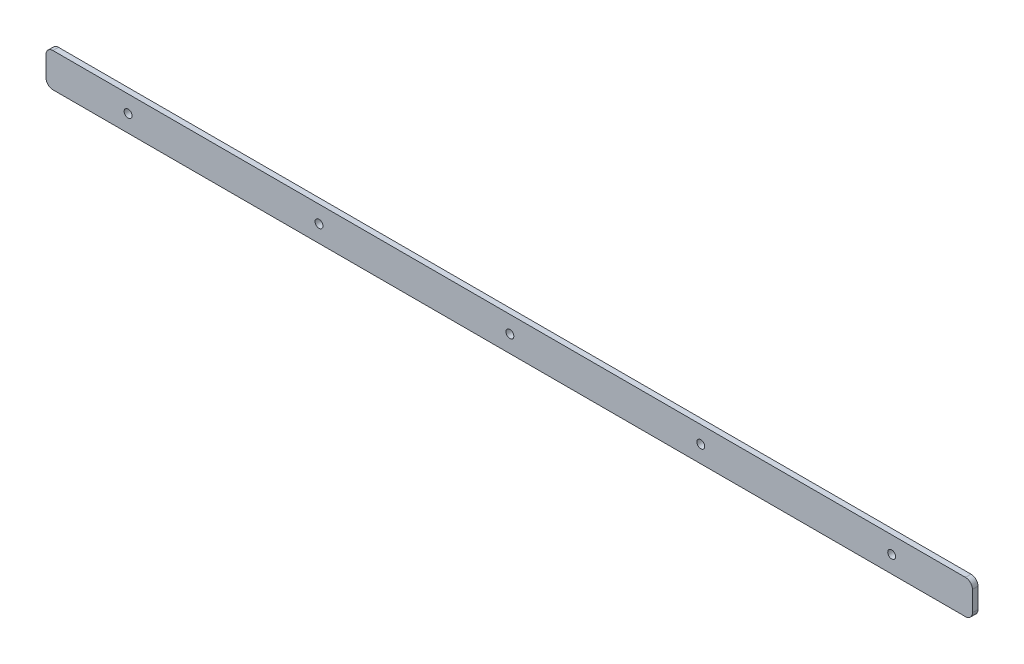
ISO-10303-21;
HEADER;
FILE_DESCRIPTION(('STEP AP214'),'2;1');
FILE_NAME('part.step','',(''),(''),'','','');
FILE_SCHEMA(('AUTOMOTIVE_DESIGN { 1 0 10303 214 1 1 1 1 }'));
ENDSEC;
DATA;
#1=APPLICATION_CONTEXT('core data for automotive mechanical design processes');
#2=APPLICATION_PROTOCOL_DEFINITION('international standard','automotive_design',2000,#1);
#3=PRODUCT_CONTEXT('',#1,'mechanical');
#4=PRODUCT('Part','Part','',(#3));
#5=PRODUCT_RELATED_PRODUCT_CATEGORY('part','',(#4));
#6=PRODUCT_DEFINITION_FORMATION('','',#4);
#7=PRODUCT_DEFINITION_CONTEXT('part definition',#1,'design');
#8=PRODUCT_DEFINITION('design','',#6,#7);
#9=PRODUCT_DEFINITION_SHAPE('','',#8);
#10=(LENGTH_UNIT() NAMED_UNIT(*) SI_UNIT(.MILLI.,.METRE.));
#11=(NAMED_UNIT(*) PLANE_ANGLE_UNIT() SI_UNIT($,.RADIAN.));
#12=(NAMED_UNIT(*) SI_UNIT($,.STERADIAN.) SOLID_ANGLE_UNIT());
#13=UNCERTAINTY_MEASURE_WITH_UNIT(LENGTH_MEASURE(1.E-05),#10,'distance_accuracy_value','');
#14=(GEOMETRIC_REPRESENTATION_CONTEXT(3) GLOBAL_UNCERTAINTY_ASSIGNED_CONTEXT((#13)) GLOBAL_UNIT_ASSIGNED_CONTEXT((#10,
#11,#12)) REPRESENTATION_CONTEXT('',''));
#15=CARTESIAN_POINT('',(0.,0.,0.));
#16=DIRECTION('',(0.,0.,1.));
#17=DIRECTION('',(1.,0.,0.));
#18=AXIS2_PLACEMENT_3D('',#15,#16,#17);
#19=CARTESIAN_POINT('',(482.727,9.7155,3.175));
#20=DIRECTION('',(0.,0.,1.));
#21=DIRECTION('',(1.,0.,0.));
#22=AXIS2_PLACEMENT_3D('',#19,#20,#21);
#23=CYLINDRICAL_SURFACE('',#22,2.24789999999999);
#24=CARTESIAN_POINT('',(482.727,9.7155,0.));
#25=DIRECTION('',(0.,0.,1.));
#26=DIRECTION('',(1.,0.,0.));
#27=AXIS2_PLACEMENT_3D('',#24,#25,#26);
#28=CIRCLE('',#27,2.2479);
#29=CARTESIAN_POINT('',(484.9749,9.7155,0.));
#30=VERTEX_POINT('',#29);
#31=EDGE_CURVE('E40',#30,#30,#28,.T.);
#32=ORIENTED_EDGE('',*,*,#31,.F.);
#33=EDGE_LOOP('',(#32));
#34=FACE_BOUND('',#33,.T.);
#35=CARTESIAN_POINT('',(482.727,9.7155,3.175));
#36=DIRECTION('',(0.,0.,1.));
#37=DIRECTION('',(1.,0.,0.));
#38=AXIS2_PLACEMENT_3D('',#35,#36,#37);
#39=CIRCLE('',#38,2.24789999999998);
#40=CARTESIAN_POINT('',(484.9749,9.7155,3.175));
#41=VERTEX_POINT('',#40);
#42=EDGE_CURVE('E11',#41,#41,#39,.T.);
#43=ORIENTED_EDGE('',*,*,#42,.T.);
#44=EDGE_LOOP('',(#43));
#45=FACE_BOUND('',#44,.T.);
#46=ADVANCED_FACE('F33',(#34,#45),#23,.F.);
#47=CARTESIAN_POINT('',(373.761,9.7155,3.175));
#48=DIRECTION('',(0.,0.,1.));
#49=DIRECTION('',(1.,0.,0.));
#50=AXIS2_PLACEMENT_3D('',#47,#48,#49);
#51=CYLINDRICAL_SURFACE('',#50,2.24789999999999);
#52=CARTESIAN_POINT('',(373.761,9.7155,0.));
#53=DIRECTION('',(0.,0.,1.));
#54=DIRECTION('',(1.,0.,0.));
#55=AXIS2_PLACEMENT_3D('',#52,#53,#54);
#56=CIRCLE('',#55,2.2479);
#57=CARTESIAN_POINT('',(376.0089,9.7155,0.));
#58=VERTEX_POINT('',#57);
#59=EDGE_CURVE('E172',#58,#58,#56,.T.);
#60=ORIENTED_EDGE('',*,*,#59,.F.);
#61=EDGE_LOOP('',(#60));
#62=FACE_BOUND('',#61,.T.);
#63=CARTESIAN_POINT('',(373.761,9.7155,3.175));
#64=DIRECTION('',(0.,0.,1.));
#65=DIRECTION('',(1.,0.,0.));
#66=AXIS2_PLACEMENT_3D('',#63,#64,#65);
#67=CIRCLE('',#66,2.24789999999998);
#68=CARTESIAN_POINT('',(376.0089,9.7155,3.175));
#69=VERTEX_POINT('',#68);
#70=EDGE_CURVE('E175',#69,#69,#67,.T.);
#71=ORIENTED_EDGE('',*,*,#70,.T.);
#72=EDGE_LOOP('',(#71));
#73=FACE_BOUND('',#72,.T.);
#74=ADVANCED_FACE('F183',(#62,#73),#51,.F.);
#75=CARTESIAN_POINT('',(264.795,9.7155,3.175));
#76=DIRECTION('',(0.,0.,1.));
#77=DIRECTION('',(1.,0.,0.));
#78=AXIS2_PLACEMENT_3D('',#75,#76,#77);
#79=CYLINDRICAL_SURFACE('',#78,2.24789999999999);
#80=CARTESIAN_POINT('',(264.795,9.7155,0.));
#81=DIRECTION('',(0.,0.,1.));
#82=DIRECTION('',(1.,0.,0.));
#83=AXIS2_PLACEMENT_3D('',#80,#81,#82);
#84=CIRCLE('',#83,2.2479);
#85=CARTESIAN_POINT('',(267.0429,9.7155,0.));
#86=VERTEX_POINT('',#85);
#87=EDGE_CURVE('E166',#86,#86,#84,.T.);
#88=ORIENTED_EDGE('',*,*,#87,.F.);
#89=EDGE_LOOP('',(#88));
#90=FACE_BOUND('',#89,.T.);
#91=CARTESIAN_POINT('',(264.795,9.7155,3.175));
#92=DIRECTION('',(0.,0.,1.));
#93=DIRECTION('',(1.,0.,0.));
#94=AXIS2_PLACEMENT_3D('',#91,#92,#93);
#95=CIRCLE('',#94,2.24789999999998);
#96=CARTESIAN_POINT('',(267.0429,9.7155,3.175));
#97=VERTEX_POINT('',#96);
#98=EDGE_CURVE('E169',#97,#97,#95,.T.);
#99=ORIENTED_EDGE('',*,*,#98,.T.);
#100=EDGE_LOOP('',(#99));
#101=FACE_BOUND('',#100,.T.);
#102=ADVANCED_FACE('F214',(#90,#101),#79,.F.);
#103=CARTESIAN_POINT('',(0.,0.,3.175));
#104=DIRECTION('',(1.,0.,0.));
#105=DIRECTION('',(0.,0.,-1.));
#106=AXIS2_PLACEMENT_3D('',#103,#104,#105);
#107=PLANE('',#106);
#108=DIRECTION('',(0.,-1.,0.));
#109=VECTOR('',#108,1.);
#110=CARTESIAN_POINT('',(0.,0.,3.175));
#111=LINE('',#110,#109);
#112=CARTESIAN_POINT('',(0.,15.46225,3.175));
#113=VERTEX_POINT('',#112);
#114=CARTESIAN_POINT('',(0.,3.96875,3.175));
#115=VERTEX_POINT('',#114);
#116=EDGE_CURVE('E119',#113,#115,#111,.T.);
#117=ORIENTED_EDGE('',*,*,#116,.F.);
#118=DIRECTION('',(0.,0.,-1.));
#119=VECTOR('',#118,1.);
#120=CARTESIAN_POINT('',(0.,15.46225,3.175));
#121=LINE('',#120,#119);
#122=CARTESIAN_POINT('',(0.,15.46225,0.));
#123=VERTEX_POINT('',#122);
#124=EDGE_CURVE('E103',#113,#123,#121,.T.);
#125=ORIENTED_EDGE('',*,*,#124,.T.);
#126=DIRECTION('',(0.,-1.,0.));
#127=VECTOR('',#126,1.);
#128=CARTESIAN_POINT('',(0.,0.,0.));
#129=LINE('',#128,#127);
#130=CARTESIAN_POINT('',(0.,3.96875,0.));
#131=VERTEX_POINT('',#130);
#132=EDGE_CURVE('E116',#123,#131,#129,.T.);
#133=ORIENTED_EDGE('',*,*,#132,.T.);
#134=DIRECTION('',(0.,0.,-1.));
#135=VECTOR('',#134,1.);
#136=CARTESIAN_POINT('',(0.,3.96875,3.175));
#137=LINE('',#136,#135);
#138=EDGE_CURVE('E121',#131,#115,#137,.F.);
#139=ORIENTED_EDGE('',*,*,#138,.T.);
#140=EDGE_LOOP('',(#117,#125,#133,#139));
#141=FACE_BOUND('',#140,.T.);
#142=ADVANCED_FACE('F115',(#141),#107,.F.);
#143=CARTESIAN_POINT('',(0.,0.,3.175));
#144=DIRECTION('',(0.,1.,0.));
#145=DIRECTION('',(0.,0.,1.));
#146=AXIS2_PLACEMENT_3D('',#143,#144,#145);
#147=PLANE('',#146);
#148=DIRECTION('',(1.,0.,0.));
#149=VECTOR('',#148,1.);
#150=CARTESIAN_POINT('',(0.,0.,3.175));
#151=LINE('',#150,#149);
#152=CARTESIAN_POINT('',(3.96875,0.,3.175));
#153=VERTEX_POINT('',#152);
#154=CARTESIAN_POINT('',(524.85925,0.,3.175));
#155=VERTEX_POINT('',#154);
#156=EDGE_CURVE('E337',#153,#155,#151,.T.);
#157=ORIENTED_EDGE('',*,*,#156,.F.);
#158=DIRECTION('',(0.,0.,-1.));
#159=VECTOR('',#158,1.);
#160=CARTESIAN_POINT('',(3.96875,0.,3.175));
#161=LINE('',#160,#159);
#162=CARTESIAN_POINT('',(3.96875,0.,0.));
#163=VERTEX_POINT('',#162);
#164=EDGE_CURVE('E159',#153,#163,#161,.T.);
#165=ORIENTED_EDGE('',*,*,#164,.T.);
#166=DIRECTION('',(1.,0.,0.));
#167=VECTOR('',#166,1.);
#168=CARTESIAN_POINT('',(0.,0.,0.));
#169=LINE('',#168,#167);
#170=CARTESIAN_POINT('',(524.85925,0.,0.));
#171=VERTEX_POINT('',#170);
#172=EDGE_CURVE('E126',#163,#171,#169,.T.);
#173=ORIENTED_EDGE('',*,*,#172,.T.);
#174=DIRECTION('',(0.,0.,-1.));
#175=VECTOR('',#174,1.);
#176=CARTESIAN_POINT('',(524.85925,0.,3.175));
#177=LINE('',#176,#175);
#178=EDGE_CURVE('E157',#171,#155,#177,.F.);
#179=ORIENTED_EDGE('',*,*,#178,.T.);
#180=EDGE_LOOP('',(#157,#165,#173,#179));
#181=FACE_BOUND('',#180,.T.);
#182=ADVANCED_FACE('F208',(#181),#147,.F.);
#183=CARTESIAN_POINT('',(528.828,0.,3.175));
#184=DIRECTION('',(-1.,0.,0.));
#185=DIRECTION('',(0.,0.,1.));
#186=AXIS2_PLACEMENT_3D('',#183,#184,#185);
#187=PLANE('',#186);
#188=DIRECTION('',(0.,1.,0.));
#189=VECTOR('',#188,1.);
#190=CARTESIAN_POINT('',(528.828,0.,3.175));
#191=LINE('',#190,#189);
#192=CARTESIAN_POINT('',(528.828,3.96875,3.175));
#193=VERTEX_POINT('',#192);
#194=CARTESIAN_POINT('',(528.828,15.46225,3.175));
#195=VERTEX_POINT('',#194);
#196=EDGE_CURVE('E338',#193,#195,#191,.T.);
#197=ORIENTED_EDGE('',*,*,#196,.F.);
#198=DIRECTION('',(0.,0.,-1.));
#199=VECTOR('',#198,1.);
#200=CARTESIAN_POINT('',(528.828,3.96875,3.175));
#201=LINE('',#200,#199);
#202=CARTESIAN_POINT('',(528.828,3.96875,0.));
#203=VERTEX_POINT('',#202);
#204=EDGE_CURVE('E163',#193,#203,#201,.T.);
#205=ORIENTED_EDGE('',*,*,#204,.T.);
#206=DIRECTION('',(0.,1.,0.));
#207=VECTOR('',#206,1.);
#208=CARTESIAN_POINT('',(528.828,0.,0.));
#209=LINE('',#208,#207);
#210=CARTESIAN_POINT('',(528.828,15.46225,0.));
#211=VERTEX_POINT('',#210);
#212=EDGE_CURVE('E130',#203,#211,#209,.T.);
#213=ORIENTED_EDGE('',*,*,#212,.T.);
#214=DIRECTION('',(0.,0.,-1.));
#215=VECTOR('',#214,1.);
#216=CARTESIAN_POINT('',(528.828,15.46225,3.175));
#217=LINE('',#216,#215);
#218=EDGE_CURVE('E47',#211,#195,#217,.F.);
#219=ORIENTED_EDGE('',*,*,#218,.T.);
#220=EDGE_LOOP('',(#197,#205,#213,#219));
#221=FACE_BOUND('',#220,.T.);
#222=ADVANCED_FACE('F198',(#221),#187,.F.);
#223=CARTESIAN_POINT('',(0.,19.431,3.175));
#224=DIRECTION('',(0.,-1.,0.));
#225=DIRECTION('',(0.,0.,-1.));
#226=AXIS2_PLACEMENT_3D('',#223,#224,#225);
#227=PLANE('',#226);
#228=DIRECTION('',(-1.,0.,0.));
#229=VECTOR('',#228,1.);
#230=CARTESIAN_POINT('',(0.,19.431,0.));
#231=LINE('',#230,#229);
#232=CARTESIAN_POINT('',(524.85925,19.431,0.));
#233=VERTEX_POINT('',#232);
#234=CARTESIAN_POINT('',(3.96875,19.431,0.));
#235=VERTEX_POINT('',#234);
#236=EDGE_CURVE('E140',#233,#235,#231,.T.);
#237=ORIENTED_EDGE('',*,*,#236,.T.);
#238=DIRECTION('',(0.,0.,-1.));
#239=VECTOR('',#238,1.);
#240=CARTESIAN_POINT('',(3.96875,19.431,3.175));
#241=LINE('',#240,#239);
#242=CARTESIAN_POINT('',(3.96875,19.431,3.175));
#243=VERTEX_POINT('',#242);
#244=EDGE_CURVE('E104',#235,#243,#241,.F.);
#245=ORIENTED_EDGE('',*,*,#244,.T.);
#246=DIRECTION('',(-1.,0.,0.));
#247=VECTOR('',#246,1.);
#248=CARTESIAN_POINT('',(0.,19.431,3.175));
#249=LINE('',#248,#247);
#250=CARTESIAN_POINT('',(524.85925,19.431,3.175));
#251=VERTEX_POINT('',#250);
#252=EDGE_CURVE('E136',#251,#243,#249,.T.);
#253=ORIENTED_EDGE('',*,*,#252,.F.);
#254=DIRECTION('',(0.,0.,-1.));
#255=VECTOR('',#254,1.);
#256=CARTESIAN_POINT('',(524.85925,19.431,3.175));
#257=LINE('',#256,#255);
#258=EDGE_CURVE('E109',#251,#233,#257,.T.);
#259=ORIENTED_EDGE('',*,*,#258,.T.);
#260=EDGE_LOOP('',(#237,#245,#253,#259));
#261=FACE_BOUND('',#260,.T.);
#262=ADVANCED_FACE('F188',(#261),#227,.F.);
#263=CARTESIAN_POINT('',(0.,0.,3.175));
#264=DIRECTION('',(0.,0.,-1.));
#265=DIRECTION('',(-1.,0.,0.));
#266=AXIS2_PLACEMENT_3D('',#263,#264,#265);
#267=PLANE('',#266);
#268=CARTESIAN_POINT('',(155.829,9.7155,3.175));
#269=DIRECTION('',(0.,0.,1.));
#270=DIRECTION('',(1.,0.,0.));
#271=AXIS2_PLACEMENT_3D('',#268,#269,#270);
#272=CIRCLE('',#271,2.24789999999998);
#273=CARTESIAN_POINT('',(158.0769,9.7155,3.175));
#274=VERTEX_POINT('',#273);
#275=EDGE_CURVE('E329',#274,#274,#272,.T.);
#276=ORIENTED_EDGE('',*,*,#275,.F.);
#277=EDGE_LOOP('',(#276));
#278=FACE_BOUND('',#277,.T.);
#279=CARTESIAN_POINT('',(46.8629999999999,9.7155,3.175));
#280=DIRECTION('',(0.,0.,1.));
#281=DIRECTION('',(1.,0.,0.));
#282=AXIS2_PLACEMENT_3D('',#279,#280,#281);
#283=CIRCLE('',#282,2.24789999999998);
#284=CARTESIAN_POINT('',(49.1108999999999,9.7155,3.175));
#285=VERTEX_POINT('',#284);
#286=EDGE_CURVE('E133',#285,#285,#283,.T.);
#287=ORIENTED_EDGE('',*,*,#286,.F.);
#288=EDGE_LOOP('',(#287));
#289=FACE_BOUND('',#288,.T.);
#290=ORIENTED_EDGE('',*,*,#252,.T.);
#291=CARTESIAN_POINT('',(3.96875,15.46225,3.175));
#292=DIRECTION('',(0.,0.,-1.));
#293=DIRECTION('',(-1.,0.,0.));
#294=AXIS2_PLACEMENT_3D('',#291,#292,#293);
#295=CIRCLE('',#294,3.96875);
#296=EDGE_CURVE('E155',#243,#113,#295,.F.);
#297=ORIENTED_EDGE('',*,*,#296,.T.);
#298=ORIENTED_EDGE('',*,*,#116,.T.);
#299=CARTESIAN_POINT('',(3.96875,3.96875,3.175));
#300=DIRECTION('',(0.,0.,-1.));
#301=DIRECTION('',(-1.,0.,0.));
#302=AXIS2_PLACEMENT_3D('',#299,#300,#301);
#303=CIRCLE('',#302,3.96875);
#304=EDGE_CURVE('E153',#115,#153,#303,.F.);
#305=ORIENTED_EDGE('',*,*,#304,.T.);
#306=ORIENTED_EDGE('',*,*,#156,.T.);
#307=CARTESIAN_POINT('',(524.85925,3.96875,3.175));
#308=DIRECTION('',(0.,0.,-1.));
#309=DIRECTION('',(-1.,0.,0.));
#310=AXIS2_PLACEMENT_3D('',#307,#308,#309);
#311=CIRCLE('',#310,3.96875);
#312=EDGE_CURVE('E54',#155,#193,#311,.F.);
#313=ORIENTED_EDGE('',*,*,#312,.T.);
#314=ORIENTED_EDGE('',*,*,#196,.T.);
#315=CARTESIAN_POINT('',(524.85925,15.46225,3.175));
#316=DIRECTION('',(0.,0.,-1.));
#317=DIRECTION('',(-1.,0.,0.));
#318=AXIS2_PLACEMENT_3D('',#315,#316,#317);
#319=CIRCLE('',#318,3.96875);
#320=EDGE_CURVE('E150',#195,#251,#319,.F.);
#321=ORIENTED_EDGE('',*,*,#320,.T.);
#322=EDGE_LOOP('',(#290,#297,#298,#305,#306,#313,#314,#321));
#323=FACE_BOUND('',#322,.T.);
#324=ORIENTED_EDGE('',*,*,#98,.F.);
#325=EDGE_LOOP('',(#324));
#326=FACE_BOUND('',#325,.T.);
#327=ORIENTED_EDGE('',*,*,#70,.F.);
#328=EDGE_LOOP('',(#327));
#329=FACE_BOUND('',#328,.T.);
#330=ORIENTED_EDGE('',*,*,#42,.F.);
#331=EDGE_LOOP('',(#330));
#332=FACE_BOUND('',#331,.T.);
#333=ADVANCED_FACE('F186',(#278,#289,#323,#326,#329,#332),#267,.F.);
#334=CARTESIAN_POINT('',(0.,0.,0.));
#335=DIRECTION('',(0.,0.,-1.));
#336=DIRECTION('',(-1.,0.,0.));
#337=AXIS2_PLACEMENT_3D('',#334,#335,#336);
#338=PLANE('',#337);
#339=CARTESIAN_POINT('',(155.829,9.7155,0.));
#340=DIRECTION('',(0.,0.,1.));
#341=DIRECTION('',(1.,0.,0.));
#342=AXIS2_PLACEMENT_3D('',#339,#340,#341);
#343=CIRCLE('',#342,2.2479);
#344=CARTESIAN_POINT('',(158.0769,9.7155,0.));
#345=VERTEX_POINT('',#344);
#346=EDGE_CURVE('E332',#345,#345,#343,.T.);
#347=ORIENTED_EDGE('',*,*,#346,.T.);
#348=EDGE_LOOP('',(#347));
#349=FACE_BOUND('',#348,.T.);
#350=CARTESIAN_POINT('',(46.8629999999999,9.7155,0.));
#351=DIRECTION('',(0.,0.,1.));
#352=DIRECTION('',(1.,0.,0.));
#353=AXIS2_PLACEMENT_3D('',#350,#351,#352);
#354=CIRCLE('',#353,2.2479);
#355=CARTESIAN_POINT('',(49.1108999999999,9.7155,0.));
#356=VERTEX_POINT('',#355);
#357=EDGE_CURVE('E127',#356,#356,#354,.T.);
#358=ORIENTED_EDGE('',*,*,#357,.T.);
#359=EDGE_LOOP('',(#358));
#360=FACE_BOUND('',#359,.T.);
#361=ORIENTED_EDGE('',*,*,#132,.F.);
#362=CARTESIAN_POINT('',(3.96875,15.46225,0.));
#363=DIRECTION('',(0.,0.,-1.));
#364=DIRECTION('',(-1.,0.,0.));
#365=AXIS2_PLACEMENT_3D('',#362,#363,#364);
#366=CIRCLE('',#365,3.96875);
#367=EDGE_CURVE('E99',#123,#235,#366,.T.);
#368=ORIENTED_EDGE('',*,*,#367,.T.);
#369=ORIENTED_EDGE('',*,*,#236,.F.);
#370=CARTESIAN_POINT('',(524.85925,15.46225,0.));
#371=DIRECTION('',(0.,0.,-1.));
#372=DIRECTION('',(-1.,0.,0.));
#373=AXIS2_PLACEMENT_3D('',#370,#371,#372);
#374=CIRCLE('',#373,3.96875);
#375=EDGE_CURVE('E120',#233,#211,#374,.T.);
#376=ORIENTED_EDGE('',*,*,#375,.T.);
#377=ORIENTED_EDGE('',*,*,#212,.F.);
#378=CARTESIAN_POINT('',(524.85925,3.96875,0.));
#379=DIRECTION('',(0.,0.,-1.));
#380=DIRECTION('',(-1.,0.,0.));
#381=AXIS2_PLACEMENT_3D('',#378,#379,#380);
#382=CIRCLE('',#381,3.96875);
#383=EDGE_CURVE('E144',#203,#171,#382,.T.);
#384=ORIENTED_EDGE('',*,*,#383,.T.);
#385=ORIENTED_EDGE('',*,*,#172,.F.);
#386=CARTESIAN_POINT('',(3.96875,3.96875,0.));
#387=DIRECTION('',(0.,0.,-1.));
#388=DIRECTION('',(-1.,0.,0.));
#389=AXIS2_PLACEMENT_3D('',#386,#387,#388);
#390=CIRCLE('',#389,3.96875);
#391=EDGE_CURVE('E110',#163,#131,#390,.T.);
#392=ORIENTED_EDGE('',*,*,#391,.T.);
#393=EDGE_LOOP('',(#361,#368,#369,#376,#377,#384,#385,#392));
#394=FACE_BOUND('',#393,.T.);
#395=ORIENTED_EDGE('',*,*,#87,.T.);
#396=EDGE_LOOP('',(#395));
#397=FACE_BOUND('',#396,.T.);
#398=ORIENTED_EDGE('',*,*,#59,.T.);
#399=EDGE_LOOP('',(#398));
#400=FACE_BOUND('',#399,.T.);
#401=ORIENTED_EDGE('',*,*,#31,.T.);
#402=EDGE_LOOP('',(#401));
#403=FACE_BOUND('',#402,.T.);
#404=ADVANCED_FACE('F123',(#349,#360,#394,#397,#400,#403),#338,.T.);
#405=CARTESIAN_POINT('',(46.8629999999999,9.7155,3.175));
#406=DIRECTION('',(0.,0.,1.));
#407=DIRECTION('',(1.,0.,0.));
#408=AXIS2_PLACEMENT_3D('',#405,#406,#407);
#409=CYLINDRICAL_SURFACE('',#408,2.24789999999999);
#410=ORIENTED_EDGE('',*,*,#357,.F.);
#411=EDGE_LOOP('',(#410));
#412=FACE_BOUND('',#411,.T.);
#413=ORIENTED_EDGE('',*,*,#286,.T.);
#414=EDGE_LOOP('',(#413));
#415=FACE_BOUND('',#414,.T.);
#416=ADVANCED_FACE('F195',(#412,#415),#409,.F.);
#417=CARTESIAN_POINT('',(3.96875,15.46225,3.175));
#418=DIRECTION('',(0.,0.,-1.));
#419=DIRECTION('',(-1.,0.,0.));
#420=AXIS2_PLACEMENT_3D('',#417,#418,#419);
#421=CYLINDRICAL_SURFACE('',#420,3.96875);
#422=ORIENTED_EDGE('',*,*,#296,.F.);
#423=ORIENTED_EDGE('',*,*,#244,.F.);
#424=ORIENTED_EDGE('',*,*,#367,.F.);
#425=ORIENTED_EDGE('',*,*,#124,.F.);
#426=EDGE_LOOP('',(#422,#423,#424,#425));
#427=FACE_BOUND('',#426,.T.);
#428=ADVANCED_FACE('F102',(#427),#421,.T.);
#429=CARTESIAN_POINT('',(3.96875,3.96875,3.175));
#430=DIRECTION('',(0.,0.,-1.));
#431=DIRECTION('',(-1.,0.,0.));
#432=AXIS2_PLACEMENT_3D('',#429,#430,#431);
#433=CYLINDRICAL_SURFACE('',#432,3.96875);
#434=ORIENTED_EDGE('',*,*,#304,.F.);
#435=ORIENTED_EDGE('',*,*,#138,.F.);
#436=ORIENTED_EDGE('',*,*,#391,.F.);
#437=ORIENTED_EDGE('',*,*,#164,.F.);
#438=EDGE_LOOP('',(#434,#435,#436,#437));
#439=FACE_BOUND('',#438,.T.);
#440=ADVANCED_FACE('F217',(#439),#433,.T.);
#441=CARTESIAN_POINT('',(524.85925,3.96875,3.175));
#442=DIRECTION('',(0.,0.,-1.));
#443=DIRECTION('',(-1.,0.,0.));
#444=AXIS2_PLACEMENT_3D('',#441,#442,#443);
#445=CYLINDRICAL_SURFACE('',#444,3.96875);
#446=ORIENTED_EDGE('',*,*,#312,.F.);
#447=ORIENTED_EDGE('',*,*,#178,.F.);
#448=ORIENTED_EDGE('',*,*,#383,.F.);
#449=ORIENTED_EDGE('',*,*,#204,.F.);
#450=EDGE_LOOP('',(#446,#447,#448,#449));
#451=FACE_BOUND('',#450,.T.);
#452=ADVANCED_FACE('F220',(#451),#445,.T.);
#453=CARTESIAN_POINT('',(524.85925,15.46225,3.175));
#454=DIRECTION('',(0.,0.,-1.));
#455=DIRECTION('',(-1.,0.,0.));
#456=AXIS2_PLACEMENT_3D('',#453,#454,#455);
#457=CYLINDRICAL_SURFACE('',#456,3.96875);
#458=ORIENTED_EDGE('',*,*,#320,.F.);
#459=ORIENTED_EDGE('',*,*,#218,.F.);
#460=ORIENTED_EDGE('',*,*,#375,.F.);
#461=ORIENTED_EDGE('',*,*,#258,.F.);
#462=EDGE_LOOP('',(#458,#459,#460,#461));
#463=FACE_BOUND('',#462,.T.);
#464=ADVANCED_FACE('F224',(#463),#457,.T.);
#465=CARTESIAN_POINT('',(155.829,9.7155,3.175));
#466=DIRECTION('',(0.,0.,1.));
#467=DIRECTION('',(1.,0.,0.));
#468=AXIS2_PLACEMENT_3D('',#465,#466,#467);
#469=CYLINDRICAL_SURFACE('',#468,2.24789999999999);
#470=ORIENTED_EDGE('',*,*,#346,.F.);
#471=EDGE_LOOP('',(#470));
#472=FACE_BOUND('',#471,.T.);
#473=ORIENTED_EDGE('',*,*,#275,.T.);
#474=EDGE_LOOP('',(#473));
#475=FACE_BOUND('',#474,.T.);
#476=ADVANCED_FACE('F228',(#472,#475),#469,.F.);
#477=CLOSED_SHELL('',(#46,#74,#102,#142,#182,#222,#262,#333,#404,#416,#428,#440,#452,#464,#476));
#478=MANIFOLD_SOLID_BREP('B2',#477);
#479=ADVANCED_BREP_SHAPE_REPRESENTATION('',(#18,#478),#14);
#480=SHAPE_DEFINITION_REPRESENTATION(#9,#479);
ENDSEC;
END-ISO-10303-21;
